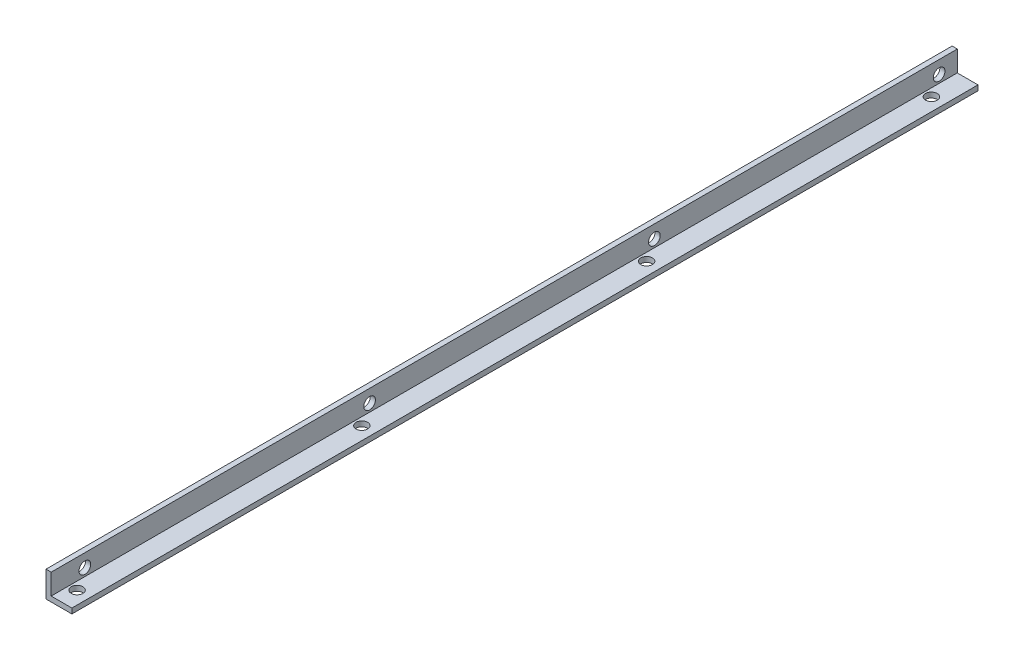
ISO-10303-21;
HEADER;
FILE_DESCRIPTION(('STEP AP214'),'2;1');
FILE_NAME('part.step','',(''),(''),'','','');
FILE_SCHEMA(('AUTOMOTIVE_DESIGN { 1 0 10303 214 1 1 1 1 }'));
ENDSEC;
DATA;
#1=APPLICATION_CONTEXT('core data for automotive mechanical design processes');
#2=APPLICATION_PROTOCOL_DEFINITION('international standard','automotive_design',2000,#1);
#3=PRODUCT_CONTEXT('',#1,'mechanical');
#4=PRODUCT('Part','Part','',(#3));
#5=PRODUCT_RELATED_PRODUCT_CATEGORY('part','',(#4));
#6=PRODUCT_DEFINITION_FORMATION('','',#4);
#7=PRODUCT_DEFINITION_CONTEXT('part definition',#1,'design');
#8=PRODUCT_DEFINITION('design','',#6,#7);
#9=PRODUCT_DEFINITION_SHAPE('','',#8);
#10=(LENGTH_UNIT() NAMED_UNIT(*) SI_UNIT(.MILLI.,.METRE.));
#11=(NAMED_UNIT(*) PLANE_ANGLE_UNIT() SI_UNIT($,.RADIAN.));
#12=(NAMED_UNIT(*) SI_UNIT($,.STERADIAN.) SOLID_ANGLE_UNIT());
#13=UNCERTAINTY_MEASURE_WITH_UNIT(LENGTH_MEASURE(1.E-05),#10,'distance_accuracy_value','');
#14=(GEOMETRIC_REPRESENTATION_CONTEXT(3) GLOBAL_UNCERTAINTY_ASSIGNED_CONTEXT((#13)) GLOBAL_UNIT_ASSIGNED_CONTEXT((#10,
#11,#12)) REPRESENTATION_CONTEXT('',''));
#15=CARTESIAN_POINT('',(0.,0.,0.));
#16=DIRECTION('',(0.,0.,1.));
#17=DIRECTION('',(1.,0.,0.));
#18=AXIS2_PLACEMENT_3D('',#15,#16,#17);
#19=CARTESIAN_POINT('',(10.,0.,350.));
#20=DIRECTION('',(0.,1.,0.));
#21=DIRECTION('',(-1.,0.,0.));
#22=AXIS2_PLACEMENT_3D('',#19,#20,#21);
#23=PLANE('',#22);
#24=CARTESIAN_POINT('',(5.,0.,13.));
#25=DIRECTION('',(0.,-1.,0.));
#26=DIRECTION('',(1.,0.,0.));
#27=AXIS2_PLACEMENT_3D('',#24,#25,#26);
#28=CIRCLE('',#27,2.25);
#29=CARTESIAN_POINT('',(7.25,0.,13.));
#30=VERTEX_POINT('',#29);
#31=EDGE_CURVE('E161',#30,#30,#28,.T.);
#32=ORIENTED_EDGE('',*,*,#31,.F.);
#33=EDGE_LOOP('',(#32));
#34=FACE_BOUND('',#33,.T.);
#35=CARTESIAN_POINT('',(5.,0.,123.));
#36=DIRECTION('',(0.,-1.,0.));
#37=DIRECTION('',(1.,0.,0.));
#38=AXIS2_PLACEMENT_3D('',#35,#36,#37);
#39=CIRCLE('',#38,2.25);
#40=CARTESIAN_POINT('',(7.25,0.,123.));
#41=VERTEX_POINT('',#40);
#42=EDGE_CURVE('E165',#41,#41,#39,.T.);
#43=ORIENTED_EDGE('',*,*,#42,.F.);
#44=EDGE_LOOP('',(#43));
#45=FACE_BOUND('',#44,.T.);
#46=CARTESIAN_POINT('',(5.,0.,233.));
#47=DIRECTION('',(0.,-1.,0.));
#48=DIRECTION('',(1.,0.,0.));
#49=AXIS2_PLACEMENT_3D('',#46,#47,#48);
#50=CIRCLE('',#49,2.25);
#51=CARTESIAN_POINT('',(7.25,0.,233.));
#52=VERTEX_POINT('',#51);
#53=EDGE_CURVE('E169',#52,#52,#50,.T.);
#54=ORIENTED_EDGE('',*,*,#53,.F.);
#55=EDGE_LOOP('',(#54));
#56=FACE_BOUND('',#55,.T.);
#57=CARTESIAN_POINT('',(5.,0.,343.));
#58=DIRECTION('',(0.,-1.,0.));
#59=DIRECTION('',(1.,0.,0.));
#60=AXIS2_PLACEMENT_3D('',#57,#58,#59);
#61=CIRCLE('',#60,2.25);
#62=CARTESIAN_POINT('',(7.25,0.,343.));
#63=VERTEX_POINT('',#62);
#64=EDGE_CURVE('E172',#63,#63,#61,.T.);
#65=ORIENTED_EDGE('',*,*,#64,.F.);
#66=EDGE_LOOP('',(#65));
#67=FACE_BOUND('',#66,.T.);
#68=DIRECTION('',(1.,0.,0.));
#69=VECTOR('',#68,1.);
#70=CARTESIAN_POINT('',(10.,0.,0.));
#71=LINE('',#70,#69);
#72=CARTESIAN_POINT('',(0.,0.,0.));
#73=VERTEX_POINT('',#72);
#74=CARTESIAN_POINT('',(10.,0.,0.));
#75=VERTEX_POINT('',#74);
#76=EDGE_CURVE('E115',#73,#75,#71,.T.);
#77=ORIENTED_EDGE('',*,*,#76,.T.);
#78=DIRECTION('',(0.,0.,-1.));
#79=VECTOR('',#78,1.);
#80=CARTESIAN_POINT('',(10.,0.,350.));
#81=LINE('',#80,#79);
#82=CARTESIAN_POINT('',(10.,0.,350.));
#83=VERTEX_POINT('',#82);
#84=EDGE_CURVE('E11',#83,#75,#81,.T.);
#85=ORIENTED_EDGE('',*,*,#84,.F.);
#86=DIRECTION('',(1.,0.,0.));
#87=VECTOR('',#86,1.);
#88=CARTESIAN_POINT('',(10.,0.,350.));
#89=LINE('',#88,#87);
#90=CARTESIAN_POINT('',(0.,0.,350.));
#91=VERTEX_POINT('',#90);
#92=EDGE_CURVE('E126',#91,#83,#89,.T.);
#93=ORIENTED_EDGE('',*,*,#92,.F.);
#94=DIRECTION('',(0.,0.,-1.));
#95=VECTOR('',#94,1.);
#96=CARTESIAN_POINT('',(0.,0.,350.));
#97=LINE('',#96,#95);
#98=EDGE_CURVE('E111',#91,#73,#97,.T.);
#99=ORIENTED_EDGE('',*,*,#98,.T.);
#100=EDGE_LOOP('',(#77,#85,#93,#99));
#101=FACE_BOUND('',#100,.T.);
#102=ADVANCED_FACE('F31',(#34,#45,#56,#67,#101),#23,.F.);
#103=CARTESIAN_POINT('',(10.,2.,350.));
#104=DIRECTION('',(-1.,0.,0.));
#105=DIRECTION('',(0.,0.,1.));
#106=AXIS2_PLACEMENT_3D('',#103,#104,#105);
#107=PLANE('',#106);
#108=DIRECTION('',(0.,1.,0.));
#109=VECTOR('',#108,1.);
#110=CARTESIAN_POINT('',(10.,2.,0.));
#111=LINE('',#110,#109);
#112=CARTESIAN_POINT('',(10.,2.,0.));
#113=VERTEX_POINT('',#112);
#114=EDGE_CURVE('E118',#75,#113,#111,.T.);
#115=ORIENTED_EDGE('',*,*,#114,.T.);
#116=DIRECTION('',(0.,0.,-1.));
#117=VECTOR('',#116,1.);
#118=CARTESIAN_POINT('',(10.,2.,350.));
#119=LINE('',#118,#117);
#120=CARTESIAN_POINT('',(10.,2.,350.));
#121=VERTEX_POINT('',#120);
#122=EDGE_CURVE('E39',#121,#113,#119,.T.);
#123=ORIENTED_EDGE('',*,*,#122,.F.);
#124=DIRECTION('',(0.,1.,0.));
#125=VECTOR('',#124,1.);
#126=CARTESIAN_POINT('',(10.,2.,350.));
#127=LINE('',#126,#125);
#128=EDGE_CURVE('E84',#83,#121,#127,.T.);
#129=ORIENTED_EDGE('',*,*,#128,.F.);
#130=ORIENTED_EDGE('',*,*,#84,.T.);
#131=EDGE_LOOP('',(#115,#123,#129,#130));
#132=FACE_BOUND('',#131,.T.);
#133=ADVANCED_FACE('F153',(#132),#107,.F.);
#134=CARTESIAN_POINT('',(2.,2.,350.));
#135=DIRECTION('',(0.,-1.,0.));
#136=DIRECTION('',(0.,0.,-1.));
#137=AXIS2_PLACEMENT_3D('',#134,#135,#136);
#138=PLANE('',#137);
#139=CARTESIAN_POINT('',(5.,2.,13.));
#140=DIRECTION('',(0.,-1.,0.));
#141=DIRECTION('',(0.,0.,-1.));
#142=AXIS2_PLACEMENT_3D('',#139,#140,#141);
#143=CIRCLE('',#142,2.25);
#144=CARTESIAN_POINT('',(5.,2.,10.75));
#145=VERTEX_POINT('',#144);
#146=EDGE_CURVE('E249',#145,#145,#143,.F.);
#147=ORIENTED_EDGE('',*,*,#146,.F.);
#148=EDGE_LOOP('',(#147));
#149=FACE_BOUND('',#148,.T.);
#150=CARTESIAN_POINT('',(5.,2.,123.));
#151=DIRECTION('',(0.,-1.,0.));
#152=DIRECTION('',(0.,0.,-1.));
#153=AXIS2_PLACEMENT_3D('',#150,#151,#152);
#154=CIRCLE('',#153,2.25);
#155=CARTESIAN_POINT('',(5.,2.,120.75));
#156=VERTEX_POINT('',#155);
#157=EDGE_CURVE('E252',#156,#156,#154,.F.);
#158=ORIENTED_EDGE('',*,*,#157,.F.);
#159=EDGE_LOOP('',(#158));
#160=FACE_BOUND('',#159,.T.);
#161=CARTESIAN_POINT('',(5.,2.,233.));
#162=DIRECTION('',(0.,-1.,0.));
#163=DIRECTION('',(0.,0.,-1.));
#164=AXIS2_PLACEMENT_3D('',#161,#162,#163);
#165=CIRCLE('',#164,2.25);
#166=CARTESIAN_POINT('',(5.,2.,230.75));
#167=VERTEX_POINT('',#166);
#168=EDGE_CURVE('E175',#167,#167,#165,.F.);
#169=ORIENTED_EDGE('',*,*,#168,.F.);
#170=EDGE_LOOP('',(#169));
#171=FACE_BOUND('',#170,.T.);
#172=CARTESIAN_POINT('',(5.,2.,343.));
#173=DIRECTION('',(0.,-1.,0.));
#174=DIRECTION('',(0.,0.,-1.));
#175=AXIS2_PLACEMENT_3D('',#172,#173,#174);
#176=CIRCLE('',#175,2.25);
#177=CARTESIAN_POINT('',(5.,2.,340.75));
#178=VERTEX_POINT('',#177);
#179=EDGE_CURVE('E174',#178,#178,#176,.F.);
#180=ORIENTED_EDGE('',*,*,#179,.F.);
#181=EDGE_LOOP('',(#180));
#182=FACE_BOUND('',#181,.T.);
#183=DIRECTION('',(-1.,0.,0.));
#184=VECTOR('',#183,1.);
#185=CARTESIAN_POINT('',(2.,2.,0.));
#186=LINE('',#185,#184);
#187=CARTESIAN_POINT('',(2.,2.,0.));
#188=VERTEX_POINT('',#187);
#189=EDGE_CURVE('E121',#113,#188,#186,.T.);
#190=ORIENTED_EDGE('',*,*,#189,.T.);
#191=DIRECTION('',(0.,0.,-1.));
#192=VECTOR('',#191,1.);
#193=CARTESIAN_POINT('',(2.,2.,350.));
#194=LINE('',#193,#192);
#195=CARTESIAN_POINT('',(2.,2.,350.));
#196=VERTEX_POINT('',#195);
#197=EDGE_CURVE('E106',#196,#188,#194,.T.);
#198=ORIENTED_EDGE('',*,*,#197,.F.);
#199=DIRECTION('',(-1.,0.,0.));
#200=VECTOR('',#199,1.);
#201=CARTESIAN_POINT('',(2.,2.,350.));
#202=LINE('',#201,#200);
#203=EDGE_CURVE('E97',#121,#196,#202,.T.);
#204=ORIENTED_EDGE('',*,*,#203,.F.);
#205=ORIENTED_EDGE('',*,*,#122,.T.);
#206=EDGE_LOOP('',(#190,#198,#204,#205));
#207=FACE_BOUND('',#206,.T.);
#208=ADVANCED_FACE('F132',(#149,#160,#171,#182,#207),#138,.F.);
#209=CARTESIAN_POINT('',(2.,10.,350.));
#210=DIRECTION('',(-1.,0.,0.));
#211=DIRECTION('',(0.,-1.,0.));
#212=AXIS2_PLACEMENT_3D('',#209,#210,#211);
#213=PLANE('',#212);
#214=CARTESIAN_POINT('',(2.,5.,337.));
#215=DIRECTION('',(-1.,0.,0.));
#216=DIRECTION('',(0.,-1.,0.));
#217=AXIS2_PLACEMENT_3D('',#214,#215,#216);
#218=CIRCLE('',#217,2.24999999999995);
#219=CARTESIAN_POINT('',(2.,2.75000000000005,337.));
#220=VERTEX_POINT('',#219);
#221=EDGE_CURVE('E186',#220,#220,#218,.T.);
#222=ORIENTED_EDGE('',*,*,#221,.T.);
#223=EDGE_LOOP('',(#222));
#224=FACE_BOUND('',#223,.T.);
#225=CARTESIAN_POINT('',(2.,5.,227.));
#226=DIRECTION('',(-1.,0.,0.));
#227=DIRECTION('',(0.,-1.,0.));
#228=AXIS2_PLACEMENT_3D('',#225,#226,#227);
#229=CIRCLE('',#228,2.25000000000001);
#230=CARTESIAN_POINT('',(2.,2.74999999999999,227.));
#231=VERTEX_POINT('',#230);
#232=EDGE_CURVE('E192',#231,#231,#229,.T.);
#233=ORIENTED_EDGE('',*,*,#232,.T.);
#234=EDGE_LOOP('',(#233));
#235=FACE_BOUND('',#234,.T.);
#236=CARTESIAN_POINT('',(2.,5.,117.));
#237=DIRECTION('',(-1.,0.,0.));
#238=DIRECTION('',(0.,-1.,0.));
#239=AXIS2_PLACEMENT_3D('',#236,#237,#238);
#240=CIRCLE('',#239,2.25000000000001);
#241=CARTESIAN_POINT('',(2.,2.74999999999999,117.));
#242=VERTEX_POINT('',#241);
#243=EDGE_CURVE('E198',#242,#242,#240,.T.);
#244=ORIENTED_EDGE('',*,*,#243,.T.);
#245=EDGE_LOOP('',(#244));
#246=FACE_BOUND('',#245,.T.);
#247=CARTESIAN_POINT('',(2.,5.,6.99999999999998));
#248=DIRECTION('',(-1.,0.,0.));
#249=DIRECTION('',(0.,-1.,0.));
#250=AXIS2_PLACEMENT_3D('',#247,#248,#249);
#251=CIRCLE('',#250,2.25);
#252=CARTESIAN_POINT('',(2.,2.75,6.99999999999998));
#253=VERTEX_POINT('',#252);
#254=EDGE_CURVE('E119',#253,#253,#251,.T.);
#255=ORIENTED_EDGE('',*,*,#254,.T.);
#256=EDGE_LOOP('',(#255));
#257=FACE_BOUND('',#256,.T.);
#258=DIRECTION('',(0.,1.,0.));
#259=VECTOR('',#258,1.);
#260=CARTESIAN_POINT('',(2.,10.,0.));
#261=LINE('',#260,#259);
#262=CARTESIAN_POINT('',(2.,10.,0.));
#263=VERTEX_POINT('',#262);
#264=EDGE_CURVE('E105',#188,#263,#261,.T.);
#265=ORIENTED_EDGE('',*,*,#264,.T.);
#266=DIRECTION('',(0.,0.,-1.));
#267=VECTOR('',#266,1.);
#268=CARTESIAN_POINT('',(2.,10.,350.));
#269=LINE('',#268,#267);
#270=CARTESIAN_POINT('',(2.,10.,350.));
#271=VERTEX_POINT('',#270);
#272=EDGE_CURVE('E102',#271,#263,#269,.T.);
#273=ORIENTED_EDGE('',*,*,#272,.F.);
#274=DIRECTION('',(0.,1.,0.));
#275=VECTOR('',#274,1.);
#276=CARTESIAN_POINT('',(2.,10.,350.));
#277=LINE('',#276,#275);
#278=EDGE_CURVE('E91',#196,#271,#277,.T.);
#279=ORIENTED_EDGE('',*,*,#278,.F.);
#280=ORIENTED_EDGE('',*,*,#197,.T.);
#281=EDGE_LOOP('',(#265,#273,#279,#280));
#282=FACE_BOUND('',#281,.T.);
#283=ADVANCED_FACE('F103',(#224,#235,#246,#257,#282),#213,.F.);
#284=CARTESIAN_POINT('',(0.,10.,350.));
#285=DIRECTION('',(0.,-1.,0.));
#286=DIRECTION('',(0.,0.,-1.));
#287=AXIS2_PLACEMENT_3D('',#284,#285,#286);
#288=PLANE('',#287);
#289=DIRECTION('',(-1.,0.,0.));
#290=VECTOR('',#289,1.);
#291=CARTESIAN_POINT('',(0.,10.,0.));
#292=LINE('',#291,#290);
#293=CARTESIAN_POINT('',(0.,10.,0.));
#294=VERTEX_POINT('',#293);
#295=EDGE_CURVE('E70',#263,#294,#292,.T.);
#296=ORIENTED_EDGE('',*,*,#295,.T.);
#297=DIRECTION('',(0.,0.,-1.));
#298=VECTOR('',#297,1.);
#299=CARTESIAN_POINT('',(0.,10.,350.));
#300=LINE('',#299,#298);
#301=CARTESIAN_POINT('',(0.,10.,350.));
#302=VERTEX_POINT('',#301);
#303=EDGE_CURVE('E107',#302,#294,#300,.T.);
#304=ORIENTED_EDGE('',*,*,#303,.F.);
#305=DIRECTION('',(-1.,0.,0.));
#306=VECTOR('',#305,1.);
#307=CARTESIAN_POINT('',(0.,10.,350.));
#308=LINE('',#307,#306);
#309=EDGE_CURVE('E95',#271,#302,#308,.T.);
#310=ORIENTED_EDGE('',*,*,#309,.F.);
#311=ORIENTED_EDGE('',*,*,#272,.T.);
#312=EDGE_LOOP('',(#296,#304,#310,#311));
#313=FACE_BOUND('',#312,.T.);
#314=ADVANCED_FACE('F109',(#313),#288,.F.);
#315=CARTESIAN_POINT('',(0.,0.,350.));
#316=DIRECTION('',(1.,0.,0.));
#317=DIRECTION('',(0.,0.,-1.));
#318=AXIS2_PLACEMENT_3D('',#315,#316,#317);
#319=PLANE('',#318);
#320=CARTESIAN_POINT('',(0.,5.,337.));
#321=DIRECTION('',(-1.,0.,0.));
#322=DIRECTION('',(0.,0.,1.));
#323=AXIS2_PLACEMENT_3D('',#320,#321,#322);
#324=CIRCLE('',#323,2.24999999999995);
#325=CARTESIAN_POINT('',(0.,5.,339.25));
#326=VERTEX_POINT('',#325);
#327=EDGE_CURVE('E178',#326,#326,#324,.T.);
#328=ORIENTED_EDGE('',*,*,#327,.F.);
#329=EDGE_LOOP('',(#328));
#330=FACE_BOUND('',#329,.T.);
#331=CARTESIAN_POINT('',(0.,5.,227.));
#332=DIRECTION('',(-1.,0.,0.));
#333=DIRECTION('',(0.,0.,1.));
#334=AXIS2_PLACEMENT_3D('',#331,#332,#333);
#335=CIRCLE('',#334,2.25000000000001);
#336=CARTESIAN_POINT('',(0.,5.,229.25));
#337=VERTEX_POINT('',#336);
#338=EDGE_CURVE('E189',#337,#337,#335,.T.);
#339=ORIENTED_EDGE('',*,*,#338,.F.);
#340=EDGE_LOOP('',(#339));
#341=FACE_BOUND('',#340,.T.);
#342=CARTESIAN_POINT('',(0.,5.,117.));
#343=DIRECTION('',(-1.,0.,0.));
#344=DIRECTION('',(0.,0.,1.));
#345=AXIS2_PLACEMENT_3D('',#342,#343,#344);
#346=CIRCLE('',#345,2.25000000000001);
#347=CARTESIAN_POINT('',(0.,5.,119.25));
#348=VERTEX_POINT('',#347);
#349=EDGE_CURVE('E195',#348,#348,#346,.T.);
#350=ORIENTED_EDGE('',*,*,#349,.F.);
#351=EDGE_LOOP('',(#350));
#352=FACE_BOUND('',#351,.T.);
#353=CARTESIAN_POINT('',(0.,5.,6.99999999999998));
#354=DIRECTION('',(-1.,0.,0.));
#355=DIRECTION('',(0.,0.,1.));
#356=AXIS2_PLACEMENT_3D('',#353,#354,#355);
#357=CIRCLE('',#356,2.25);
#358=CARTESIAN_POINT('',(0.,5.,9.24999999999998));
#359=VERTEX_POINT('',#358);
#360=EDGE_CURVE('E201',#359,#359,#357,.T.);
#361=ORIENTED_EDGE('',*,*,#360,.F.);
#362=EDGE_LOOP('',(#361));
#363=FACE_BOUND('',#362,.T.);
#364=DIRECTION('',(0.,-1.,0.));
#365=VECTOR('',#364,1.);
#366=CARTESIAN_POINT('',(0.,0.,0.));
#367=LINE('',#366,#365);
#368=EDGE_CURVE('E76',#294,#73,#367,.T.);
#369=ORIENTED_EDGE('',*,*,#368,.T.);
#370=ORIENTED_EDGE('',*,*,#98,.F.);
#371=DIRECTION('',(0.,-1.,0.));
#372=VECTOR('',#371,1.);
#373=CARTESIAN_POINT('',(0.,0.,350.));
#374=LINE('',#373,#372);
#375=EDGE_CURVE('E47',#302,#91,#374,.T.);
#376=ORIENTED_EDGE('',*,*,#375,.F.);
#377=ORIENTED_EDGE('',*,*,#303,.T.);
#378=EDGE_LOOP('',(#369,#370,#376,#377));
#379=FACE_BOUND('',#378,.T.);
#380=ADVANCED_FACE('F139',(#330,#341,#352,#363,#379),#319,.F.);
#381=CARTESIAN_POINT('',(0.,0.,350.));
#382=DIRECTION('',(0.,0.,-1.));
#383=DIRECTION('',(-1.,0.,0.));
#384=AXIS2_PLACEMENT_3D('',#381,#382,#383);
#385=PLANE('',#384);
#386=ORIENTED_EDGE('',*,*,#92,.T.);
#387=ORIENTED_EDGE('',*,*,#128,.T.);
#388=ORIENTED_EDGE('',*,*,#203,.T.);
#389=ORIENTED_EDGE('',*,*,#278,.T.);
#390=ORIENTED_EDGE('',*,*,#309,.T.);
#391=ORIENTED_EDGE('',*,*,#375,.T.);
#392=EDGE_LOOP('',(#386,#387,#388,#389,#390,#391));
#393=FACE_BOUND('',#392,.T.);
#394=ADVANCED_FACE('F93',(#393),#385,.F.);
#395=CARTESIAN_POINT('',(0.,0.,0.));
#396=DIRECTION('',(0.,0.,-1.));
#397=DIRECTION('',(-1.,0.,0.));
#398=AXIS2_PLACEMENT_3D('',#395,#396,#397);
#399=PLANE('',#398);
#400=ORIENTED_EDGE('',*,*,#76,.F.);
#401=ORIENTED_EDGE('',*,*,#368,.F.);
#402=ORIENTED_EDGE('',*,*,#295,.F.);
#403=ORIENTED_EDGE('',*,*,#264,.F.);
#404=ORIENTED_EDGE('',*,*,#189,.F.);
#405=ORIENTED_EDGE('',*,*,#114,.F.);
#406=EDGE_LOOP('',(#400,#401,#402,#403,#404,#405));
#407=FACE_BOUND('',#406,.T.);
#408=ADVANCED_FACE('F135',(#407),#399,.T.);
#409=CARTESIAN_POINT('',(10.,5.,6.99999999999998));
#410=DIRECTION('',(-1.,0.,0.));
#411=DIRECTION('',(0.,0.,1.));
#412=AXIS2_PLACEMENT_3D('',#409,#410,#411);
#413=CYLINDRICAL_SURFACE('',#412,2.25);
#414=ORIENTED_EDGE('',*,*,#360,.T.);
#415=EDGE_LOOP('',(#414));
#416=FACE_BOUND('',#415,.T.);
#417=ORIENTED_EDGE('',*,*,#254,.F.);
#418=EDGE_LOOP('',(#417));
#419=FACE_BOUND('',#418,.T.);
#420=ADVANCED_FACE('F210',(#416,#419),#413,.F.);
#421=CARTESIAN_POINT('',(10.,5.,117.));
#422=DIRECTION('',(-1.,0.,0.));
#423=DIRECTION('',(0.,0.,1.));
#424=AXIS2_PLACEMENT_3D('',#421,#422,#423);
#425=CYLINDRICAL_SURFACE('',#424,2.25000000000001);
#426=ORIENTED_EDGE('',*,*,#349,.T.);
#427=EDGE_LOOP('',(#426));
#428=FACE_BOUND('',#427,.T.);
#429=ORIENTED_EDGE('',*,*,#243,.F.);
#430=EDGE_LOOP('',(#429));
#431=FACE_BOUND('',#430,.T.);
#432=ADVANCED_FACE('F212',(#428,#431),#425,.F.);
#433=CARTESIAN_POINT('',(10.,5.,227.));
#434=DIRECTION('',(-1.,0.,0.));
#435=DIRECTION('',(0.,0.,1.));
#436=AXIS2_PLACEMENT_3D('',#433,#434,#435);
#437=CYLINDRICAL_SURFACE('',#436,2.25000000000001);
#438=ORIENTED_EDGE('',*,*,#338,.T.);
#439=EDGE_LOOP('',(#438));
#440=FACE_BOUND('',#439,.T.);
#441=ORIENTED_EDGE('',*,*,#232,.F.);
#442=EDGE_LOOP('',(#441));
#443=FACE_BOUND('',#442,.T.);
#444=ADVANCED_FACE('F219',(#440,#443),#437,.F.);
#445=CARTESIAN_POINT('',(10.,5.,337.));
#446=DIRECTION('',(-1.,0.,0.));
#447=DIRECTION('',(0.,0.,1.));
#448=AXIS2_PLACEMENT_3D('',#445,#446,#447);
#449=CYLINDRICAL_SURFACE('',#448,2.24999999999995);
#450=ORIENTED_EDGE('',*,*,#327,.T.);
#451=EDGE_LOOP('',(#450));
#452=FACE_BOUND('',#451,.T.);
#453=ORIENTED_EDGE('',*,*,#221,.F.);
#454=EDGE_LOOP('',(#453));
#455=FACE_BOUND('',#454,.T.);
#456=ADVANCED_FACE('F225',(#452,#455),#449,.F.);
#457=CARTESIAN_POINT('',(5.,10.001,343.));
#458=DIRECTION('',(0.,-1.,0.));
#459=DIRECTION('',(1.,0.,0.));
#460=AXIS2_PLACEMENT_3D('',#457,#458,#459);
#461=CYLINDRICAL_SURFACE('',#460,2.25);
#462=ORIENTED_EDGE('',*,*,#64,.T.);
#463=EDGE_LOOP('',(#462));
#464=FACE_BOUND('',#463,.T.);
#465=ORIENTED_EDGE('',*,*,#179,.T.);
#466=EDGE_LOOP('',(#465));
#467=FACE_BOUND('',#466,.T.);
#468=ADVANCED_FACE('F229',(#464,#467),#461,.F.);
#469=CARTESIAN_POINT('',(5.,10.001,233.));
#470=DIRECTION('',(0.,-1.,0.));
#471=DIRECTION('',(1.,0.,0.));
#472=AXIS2_PLACEMENT_3D('',#469,#470,#471);
#473=CYLINDRICAL_SURFACE('',#472,2.25);
#474=ORIENTED_EDGE('',*,*,#53,.T.);
#475=EDGE_LOOP('',(#474));
#476=FACE_BOUND('',#475,.T.);
#477=ORIENTED_EDGE('',*,*,#168,.T.);
#478=EDGE_LOOP('',(#477));
#479=FACE_BOUND('',#478,.T.);
#480=ADVANCED_FACE('F233',(#476,#479),#473,.F.);
#481=CARTESIAN_POINT('',(5.,10.001,123.));
#482=DIRECTION('',(0.,-1.,0.));
#483=DIRECTION('',(1.,0.,0.));
#484=AXIS2_PLACEMENT_3D('',#481,#482,#483);
#485=CYLINDRICAL_SURFACE('',#484,2.25);
#486=ORIENTED_EDGE('',*,*,#42,.T.);
#487=EDGE_LOOP('',(#486));
#488=FACE_BOUND('',#487,.T.);
#489=ORIENTED_EDGE('',*,*,#157,.T.);
#490=EDGE_LOOP('',(#489));
#491=FACE_BOUND('',#490,.T.);
#492=ADVANCED_FACE('F236',(#488,#491),#485,.F.);
#493=CARTESIAN_POINT('',(5.,10.001,13.));
#494=DIRECTION('',(0.,-1.,0.));
#495=DIRECTION('',(1.,0.,0.));
#496=AXIS2_PLACEMENT_3D('',#493,#494,#495);
#497=CYLINDRICAL_SURFACE('',#496,2.25);
#498=ORIENTED_EDGE('',*,*,#31,.T.);
#499=EDGE_LOOP('',(#498));
#500=FACE_BOUND('',#499,.T.);
#501=ORIENTED_EDGE('',*,*,#146,.T.);
#502=EDGE_LOOP('',(#501));
#503=FACE_BOUND('',#502,.T.);
#504=ADVANCED_FACE('F240',(#500,#503),#497,.F.);
#505=CLOSED_SHELL('',(#102,#133,#208,#283,#314,#380,#394,#408,#420,#432,#444,#456,#468,#480,
#492,#504));
#506=MANIFOLD_SOLID_BREP('B2',#505);
#507=ADVANCED_BREP_SHAPE_REPRESENTATION('',(#18,#506),#14);
#508=SHAPE_DEFINITION_REPRESENTATION(#9,#507);
ENDSEC;
END-ISO-10303-21;
